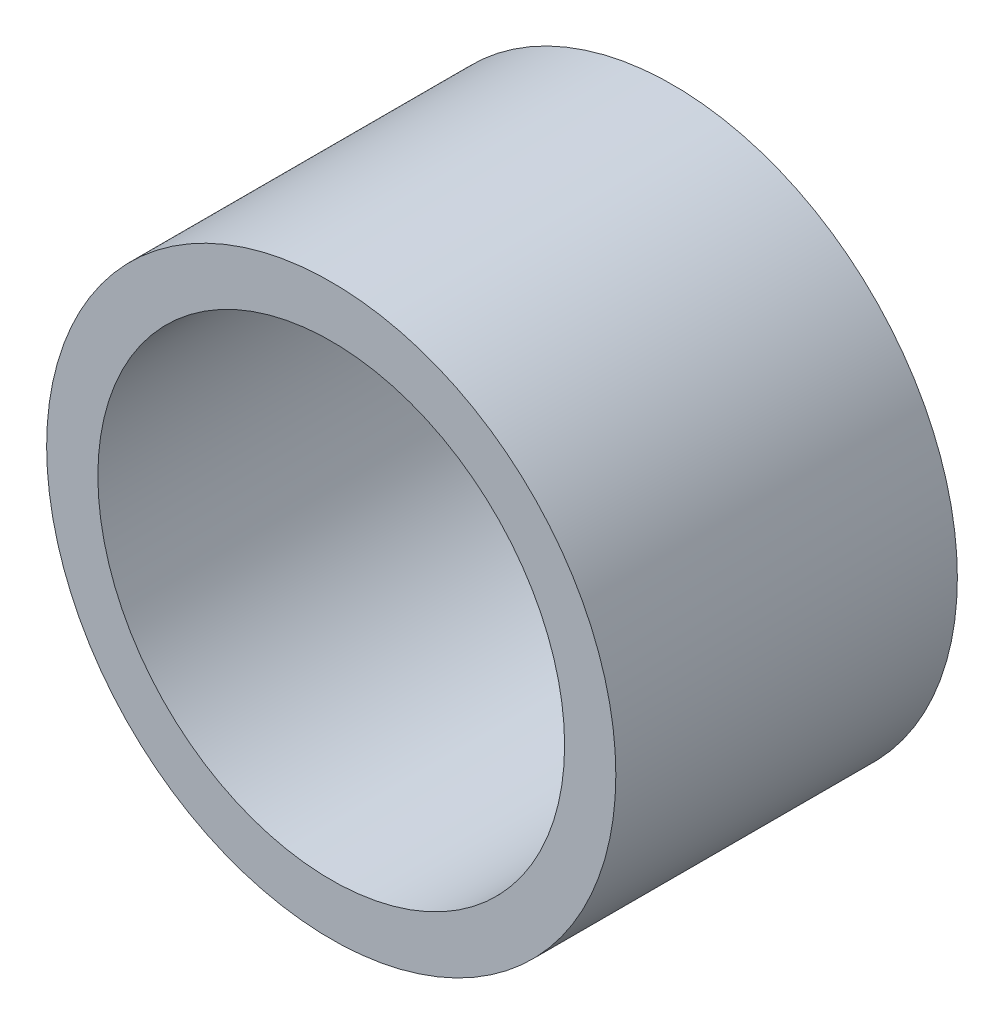
ISO-10303-21;
HEADER;
FILE_DESCRIPTION(('STEP AP214'),'2;1');
FILE_NAME('part.step','',(''),(''),'','','');
FILE_SCHEMA(('AUTOMOTIVE_DESIGN { 1 0 10303 214 1 1 1 1 }'));
ENDSEC;
DATA;
#1=APPLICATION_CONTEXT('core data for automotive mechanical design processes');
#2=APPLICATION_PROTOCOL_DEFINITION('international standard','automotive_design',2000,#1);
#3=PRODUCT_CONTEXT('',#1,'mechanical');
#4=PRODUCT('Part','Part','',(#3));
#5=PRODUCT_RELATED_PRODUCT_CATEGORY('part','',(#4));
#6=PRODUCT_DEFINITION_FORMATION('','',#4);
#7=PRODUCT_DEFINITION_CONTEXT('part definition',#1,'design');
#8=PRODUCT_DEFINITION('design','',#6,#7);
#9=PRODUCT_DEFINITION_SHAPE('','',#8);
#10=(LENGTH_UNIT() NAMED_UNIT(*) SI_UNIT(.MILLI.,.METRE.));
#11=(NAMED_UNIT(*) PLANE_ANGLE_UNIT() SI_UNIT($,.RADIAN.));
#12=(NAMED_UNIT(*) SI_UNIT($,.STERADIAN.) SOLID_ANGLE_UNIT());
#13=UNCERTAINTY_MEASURE_WITH_UNIT(LENGTH_MEASURE(1.E-05),#10,'distance_accuracy_value','');
#14=(GEOMETRIC_REPRESENTATION_CONTEXT(3) GLOBAL_UNCERTAINTY_ASSIGNED_CONTEXT((#13)) GLOBAL_UNIT_ASSIGNED_CONTEXT((#10,
#11,#12)) REPRESENTATION_CONTEXT('',''));
#15=CARTESIAN_POINT('',(0.,0.,0.));
#16=DIRECTION('',(0.,0.,1.));
#17=DIRECTION('',(1.,0.,0.));
#18=AXIS2_PLACEMENT_3D('',#15,#16,#17);
#19=CARTESIAN_POINT('',(69.890486909986,-10.0251664969289,30.));
#20=DIRECTION('',(0.,0.,1.));
#21=DIRECTION('',(1.,0.,0.));
#22=AXIS2_PLACEMENT_3D('',#19,#20,#21);
#23=PLANE('',#22);
#24=CARTESIAN_POINT('',(69.890486909986,-10.0251664969289,30.));
#25=DIRECTION('',(0.,0.,1.));
#26=DIRECTION('',(1.,0.,0.));
#27=AXIS2_PLACEMENT_3D('',#24,#25,#26);
#28=CIRCLE('',#27,25.);
#29=CARTESIAN_POINT('',(94.890486909986,-10.0251664969289,30.));
#30=VERTEX_POINT('',#29);
#31=EDGE_CURVE('E10',#30,#30,#28,.T.);
#32=ORIENTED_EDGE('',*,*,#31,.T.);
#33=EDGE_LOOP('',(#32));
#34=FACE_BOUND('',#33,.T.);
#35=CARTESIAN_POINT('',(69.890486909986,-10.0251664969289,30.));
#36=DIRECTION('',(0.,0.,1.));
#37=DIRECTION('',(1.,0.,0.));
#38=AXIS2_PLACEMENT_3D('',#35,#36,#37);
#39=CIRCLE('',#38,20.5);
#40=CARTESIAN_POINT('',(90.390486909986,-10.0251664969289,30.));
#41=VERTEX_POINT('',#40);
#42=EDGE_CURVE('E43',#41,#41,#39,.T.);
#43=ORIENTED_EDGE('',*,*,#42,.F.);
#44=EDGE_LOOP('',(#43));
#45=FACE_BOUND('',#44,.T.);
#46=ADVANCED_FACE('F32',(#34,#45),#23,.T.);
#47=CARTESIAN_POINT('',(69.890486909986,-10.0251664969289,0.));
#48=DIRECTION('',(0.,0.,1.));
#49=DIRECTION('',(1.,0.,0.));
#50=AXIS2_PLACEMENT_3D('',#47,#48,#49);
#51=PLANE('',#50);
#52=CARTESIAN_POINT('',(69.890486909986,-10.0251664969289,0.));
#53=DIRECTION('',(0.,0.,1.));
#54=DIRECTION('',(1.,0.,0.));
#55=AXIS2_PLACEMENT_3D('',#52,#53,#54);
#56=CIRCLE('',#55,25.);
#57=CARTESIAN_POINT('',(94.890486909986,-10.0251664969289,0.));
#58=VERTEX_POINT('',#57);
#59=EDGE_CURVE('E36',#58,#58,#56,.T.);
#60=ORIENTED_EDGE('',*,*,#59,.F.);
#61=EDGE_LOOP('',(#60));
#62=FACE_BOUND('',#61,.T.);
#63=CARTESIAN_POINT('',(69.890486909986,-10.0251664969289,0.));
#64=DIRECTION('',(0.,0.,1.));
#65=DIRECTION('',(1.,0.,0.));
#66=AXIS2_PLACEMENT_3D('',#63,#64,#65);
#67=CIRCLE('',#66,20.5);
#68=CARTESIAN_POINT('',(90.390486909986,-10.0251664969289,0.));
#69=VERTEX_POINT('',#68);
#70=EDGE_CURVE('E45',#69,#69,#67,.T.);
#71=ORIENTED_EDGE('',*,*,#70,.T.);
#72=EDGE_LOOP('',(#71));
#73=FACE_BOUND('',#72,.T.);
#74=ADVANCED_FACE('F55',(#62,#73),#51,.F.);
#75=CARTESIAN_POINT('',(69.890486909986,-10.0251664969289,30.));
#76=DIRECTION('',(0.,0.,-1.));
#77=DIRECTION('',(-1.,0.,0.));
#78=AXIS2_PLACEMENT_3D('',#75,#76,#77);
#79=CYLINDRICAL_SURFACE('',#78,25.);
#80=ORIENTED_EDGE('',*,*,#31,.F.);
#81=EDGE_LOOP('',(#80));
#82=FACE_BOUND('',#81,.T.);
#83=ORIENTED_EDGE('',*,*,#59,.T.);
#84=EDGE_LOOP('',(#83));
#85=FACE_BOUND('',#84,.T.);
#86=ADVANCED_FACE('F34',(#82,#85),#79,.T.);
#87=CARTESIAN_POINT('',(69.890486909986,-10.0251664969289,30.));
#88=DIRECTION('',(0.,0.,-1.));
#89=DIRECTION('',(-1.,0.,0.));
#90=AXIS2_PLACEMENT_3D('',#87,#88,#89);
#91=CYLINDRICAL_SURFACE('',#90,20.5);
#92=ORIENTED_EDGE('',*,*,#42,.T.);
#93=EDGE_LOOP('',(#92));
#94=FACE_BOUND('',#93,.T.);
#95=ORIENTED_EDGE('',*,*,#70,.F.);
#96=EDGE_LOOP('',(#95));
#97=FACE_BOUND('',#96,.T.);
#98=ADVANCED_FACE('F51',(#94,#97),#91,.F.);
#99=CLOSED_SHELL('',(#46,#74,#86,#98));
#100=MANIFOLD_SOLID_BREP('B2',#99);
#101=ADVANCED_BREP_SHAPE_REPRESENTATION('',(#18,#100),#14);
#102=SHAPE_DEFINITION_REPRESENTATION(#9,#101);
ENDSEC;
END-ISO-10303-21;
